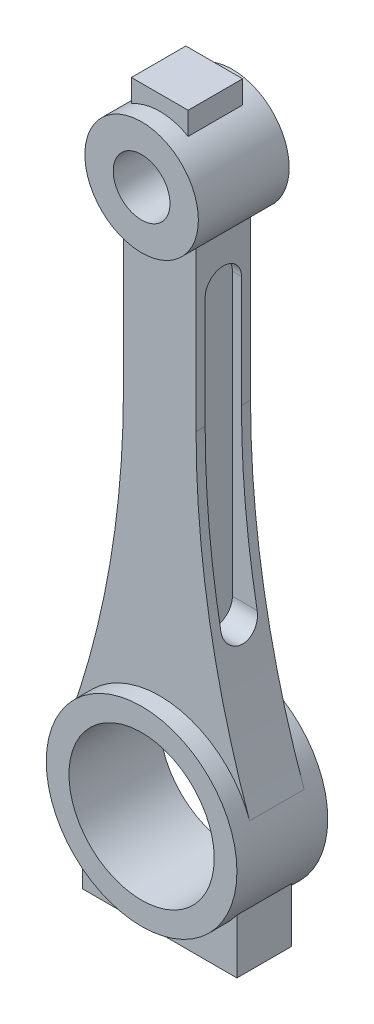
ISO-10303-21;
HEADER;
FILE_DESCRIPTION(('STEP AP214'),'2;1');
FILE_NAME('part.step','',(''),(''),'','','');
FILE_SCHEMA(('AUTOMOTIVE_DESIGN { 1 0 10303 214 1 1 1 1 }'));
ENDSEC;
DATA;
#1=APPLICATION_CONTEXT('core data for automotive mechanical design processes');
#2=APPLICATION_PROTOCOL_DEFINITION('international standard','automotive_design',2000,#1);
#3=PRODUCT_CONTEXT('',#1,'mechanical');
#4=PRODUCT('Part','Part','',(#3));
#5=PRODUCT_RELATED_PRODUCT_CATEGORY('part','',(#4));
#6=PRODUCT_DEFINITION_FORMATION('','',#4);
#7=PRODUCT_DEFINITION_CONTEXT('part definition',#1,'design');
#8=PRODUCT_DEFINITION('design','',#6,#7);
#9=PRODUCT_DEFINITION_SHAPE('','',#8);
#10=(LENGTH_UNIT() NAMED_UNIT(*) SI_UNIT(.MILLI.,.METRE.));
#11=(NAMED_UNIT(*) PLANE_ANGLE_UNIT() SI_UNIT($,.RADIAN.));
#12=(NAMED_UNIT(*) SI_UNIT($,.STERADIAN.) SOLID_ANGLE_UNIT());
#13=UNCERTAINTY_MEASURE_WITH_UNIT(LENGTH_MEASURE(1.E-05),#10,'distance_accuracy_value','');
#14=(GEOMETRIC_REPRESENTATION_CONTEXT(3) GLOBAL_UNCERTAINTY_ASSIGNED_CONTEXT((#13)) GLOBAL_UNIT_ASSIGNED_CONTEXT((#10,
#11,#12)) REPRESENTATION_CONTEXT('',''));
#15=CARTESIAN_POINT('',(0.,0.,0.));
#16=DIRECTION('',(0.,0.,1.));
#17=DIRECTION('',(1.,0.,0.));
#18=AXIS2_PLACEMENT_3D('',#15,#16,#17);
#19=CARTESIAN_POINT('',(212.132819979024,75.3953136438508,6.));
#20=DIRECTION('',(0.,0.,-1.));
#21=DIRECTION('',(-1.,0.,0.));
#22=AXIS2_PLACEMENT_3D('',#19,#20,#21);
#23=CYLINDRICAL_SURFACE('',#22,204.132819979024);
#24=CARTESIAN_POINT('',(11.4544735884215,38.,-4.00000000000001));
#25=CARTESIAN_POINT('',(11.4757515518411,37.8858086335559,-4.00000967356236));
#26=CARTESIAN_POINT('',(11.497127848932,37.7716411229782,-3.9951101211208));
#27=CARTESIAN_POINT('',(11.5399210356049,37.544152772884,-3.97557755361704));
#28=CARTESIAN_POINT('',(11.5613379239584,37.4308319082382,-3.9609448286138));
#29=CARTESIAN_POINT('',(11.6040518019029,37.2058589467753,-3.92203609087538));
#30=CARTESIAN_POINT('',(11.6253488219803,37.0942064124742,-3.89776265395078));
#31=CARTESIAN_POINT('',(11.6676599337569,36.8733657612217,-3.83975872762631));
#32=CARTESIAN_POINT('',(11.6886740293759,36.7641776101131,-3.80602836938937));
#33=CARTESIAN_POINT('',(11.7510730473326,36.4413470108117,-3.69089420326938));
#34=CARTESIAN_POINT('',(11.7918289081029,36.2323636826891,-3.59553432969807));
#35=CARTESIAN_POINT('',(11.8702126062764,35.833491871712,-3.37027556179513));
#36=CARTESIAN_POINT('',(11.9078413597511,35.643597793309,-3.24038682968162));
#37=CARTESIAN_POINT('',(11.9784728244352,35.2894796680367,-2.95043691024399));
#38=CARTESIAN_POINT('',(12.0115036519544,35.1250988255321,-2.79057453802654));
#39=CARTESIAN_POINT('',(12.0720036427705,34.8256035029566,-2.44449926104123));
#40=CARTESIAN_POINT('',(12.0994724370193,34.6904909648341,-2.25828460915733));
#41=CARTESIAN_POINT('',(12.1473413477104,34.4559602912754,-1.86832249559896));
#42=CARTESIAN_POINT('',(12.1678582991115,34.3559510460777,-1.664944991045));
#43=CARTESIAN_POINT('',(12.201667760202,34.1915558050773,-1.24372237948287));
#44=CARTESIAN_POINT('',(12.2149615713728,34.1271633917176,-1.0258798867516));
#45=CARTESIAN_POINT('',(12.2336033492388,34.0369591960168,-0.586274812122698));
#46=CARTESIAN_POINT('',(12.2390950212482,34.0104496060439,-0.364661335561847));
#47=CARTESIAN_POINT('',(12.2423732155319,33.9946184843632,0.0799443502249516));
#48=CARTESIAN_POINT('',(12.2401601145853,34.0052951341723,0.302936491499045));
#49=CARTESIAN_POINT('',(12.2281765408432,34.0632127244266,0.741781925824326));
#50=CARTESIAN_POINT('',(12.2184766498272,34.1101121767816,0.957682365575714));
#51=CARTESIAN_POINT('',(12.1919895794175,34.2385791029979,1.37844153266759));
#52=CARTESIAN_POINT('',(12.1752023313576,34.3201469127454,1.58330015300715));
#53=CARTESIAN_POINT('',(12.1350793834177,34.5159552856904,1.97739776157501));
#54=CARTESIAN_POINT('',(12.1117098081663,34.6303649264094,2.16654921549124));
#55=CARTESIAN_POINT('',(12.0593260749273,34.8882465100265,2.52297125984128));
#56=CARTESIAN_POINT('',(12.0303117725959,35.0317191961119,2.69024129055299));
#57=CARTESIAN_POINT('',(11.9671383735568,35.3461665633751,3.00114206510915));
#58=CARTESIAN_POINT('',(11.9329025496515,35.5175545383741,3.1443390498194));
#59=CARTESIAN_POINT('',(11.8607975408038,35.8812712267655,3.40006280722765));
#60=CARTESIAN_POINT('',(11.8229268395298,36.0736086840292,3.51257670427657));
#61=CARTESIAN_POINT('',(11.744011046999,36.4777513253325,3.70593438635492));
#62=CARTESIAN_POINT('',(11.7029182624971,36.6898643551292,3.78611370956408));
#63=CARTESIAN_POINT('',(11.6195357198389,37.1241795414682,3.90944320644274));
#64=CARTESIAN_POINT('',(11.5772477716993,37.3463667203578,3.95264656840455));
#65=CARTESIAN_POINT('',(11.5215540274853,37.6417241762258,3.98457340087694));
#66=CARTESIAN_POINT('',(11.5080944382149,37.713314753212,3.99036111817268));
#67=CARTESIAN_POINT('',(11.4812368188341,37.8565916807734,3.99806924003837));
#68=CARTESIAN_POINT('',(11.467838723541,37.9282776734255,3.99999606757804));
#69=CARTESIAN_POINT('',(11.4544735884215,38.,3.99999999999999));
#70=B_SPLINE_CURVE_WITH_KNOTS('',3,(#24,#25,#26,#27,#28,#29,#30,#31,#32,#33,#34,#35,#36,#37,#38,
#39,#40,#41,#42,#43,#44,#45,#46,#47,#48,#49,#50,#51,#52,#53,#54,#55,#56,#57,#58,#59,#60,#61,#62,
#63,#64,#65,#66,#67,#68,#69),.UNSPECIFIED.,.F.,.F.,(4,2,2,2,2,2,2,2,2,2,2,2,2,2,2,2,2,2,2,2,2,2,
4),(0.,0.348357600629778,0.696704820295753,1.04495903090801,1.39320841164155,2.08947857427322,
2.78554404346985,3.47714614167073,4.16879411353831,4.84816302804556,5.52740949173436,
6.1939753168709,6.86050854603357,7.52083364695976,8.18116514562695,8.84495910470899,
9.50877004017902,10.1834922182609,10.8584970981523,11.546741507572,12.2339942357506,
12.4531452672714,12.6719314158043),.UNSPECIFIED.);
#71=CARTESIAN_POINT('',(11.4544735884215,38.,-4.00000000000001));
#72=VERTEX_POINT('',#71);
#73=CARTESIAN_POINT('',(11.4544735884215,38.,3.99999999999999));
#74=VERTEX_POINT('',#73);
#75=EDGE_CURVE('E400',#72,#74,#70,.T.);
#76=ORIENTED_EDGE('',*,*,#75,.T.);
#77=CARTESIAN_POINT('',(212.132819979024,75.3953136438508,3.99999999999999));
#78=DIRECTION('',(0.,0.,-1.));
#79=DIRECTION('',(0.,1.,0.));
#80=AXIS2_PLACEMENT_3D('',#77,#78,#79);
#81=CIRCLE('',#80,204.132819979024);
#82=CARTESIAN_POINT('',(8.00000000000001,75.3953136438507,4.));
#83=VERTEX_POINT('',#82);
#84=EDGE_CURVE('E250',#74,#83,#81,.T.);
#85=ORIENTED_EDGE('',*,*,#84,.T.);
#86=DIRECTION('',(0.,0.,-1.));
#87=VECTOR('',#86,1.);
#88=CARTESIAN_POINT('',(8.00000000000001,75.3953136438507,6.));
#89=LINE('',#88,#87);
#90=CARTESIAN_POINT('',(8.00000000000001,75.3953136438507,6.));
#91=VERTEX_POINT('',#90);
#92=EDGE_CURVE('E367',#91,#83,#89,.T.);
#93=ORIENTED_EDGE('',*,*,#92,.F.);
#94=CARTESIAN_POINT('',(212.132819979024,75.3953136438508,6.));
#95=DIRECTION('',(0.,0.,1.));
#96=DIRECTION('',(1.,0.,0.));
#97=AXIS2_PLACEMENT_3D('',#94,#95,#96);
#98=CIRCLE('',#97,204.132819979024);
#99=CARTESIAN_POINT('',(19.7873824881444,7.03274443356766,6.));
#100=VERTEX_POINT('',#99);
#101=EDGE_CURVE('E342',#91,#100,#98,.T.);
#102=ORIENTED_EDGE('',*,*,#101,.T.);
#103=DIRECTION('',(0.,0.,-1.));
#104=VECTOR('',#103,1.);
#105=CARTESIAN_POINT('',(19.7873824881444,7.03274443356764,6.));
#106=LINE('',#105,#104);
#107=CARTESIAN_POINT('',(19.7873824881444,7.03274443356765,-6.));
#108=VERTEX_POINT('',#107);
#109=EDGE_CURVE('E370',#100,#108,#106,.T.);
#110=ORIENTED_EDGE('',*,*,#109,.T.);
#111=CARTESIAN_POINT('',(212.132819979024,75.3953136438508,-6.));
#112=DIRECTION('',(0.,0.,1.));
#113=DIRECTION('',(1.,0.,0.));
#114=AXIS2_PLACEMENT_3D('',#111,#112,#113);
#115=CIRCLE('',#114,204.132819979024);
#116=CARTESIAN_POINT('',(8.00000000000001,75.3953136438507,-6.));
#117=VERTEX_POINT('',#116);
#118=EDGE_CURVE('E360',#117,#108,#115,.T.);
#119=ORIENTED_EDGE('',*,*,#118,.F.);
#120=CARTESIAN_POINT('',(8.00000000000001,75.3953136438507,-4.));
#121=VERTEX_POINT('',#120);
#122=EDGE_CURVE('E366',#121,#117,#89,.T.);
#123=ORIENTED_EDGE('',*,*,#122,.F.);
#124=CARTESIAN_POINT('',(212.132819979024,75.3953136438508,-4.00000000000001));
#125=DIRECTION('',(0.,0.,1.));
#126=DIRECTION('',(0.,-1.,0.));
#127=AXIS2_PLACEMENT_3D('',#124,#125,#126);
#128=CIRCLE('',#127,204.132819979024);
#129=EDGE_CURVE('E58',#121,#72,#128,.T.);
#130=ORIENTED_EDGE('',*,*,#129,.T.);
#131=EDGE_LOOP('',(#76,#85,#93,#102,#110,#119,#123,#130));
#132=FACE_BOUND('',#131,.T.);
#133=ADVANCED_FACE('F35',(#132),#23,.F.);
#134=CARTESIAN_POINT('',(8.00000000000003,0.,6.));
#135=DIRECTION('',(-1.,0.,0.));
#136=DIRECTION('',(0.,-1.,0.));
#137=AXIS2_PLACEMENT_3D('',#134,#135,#136);
#138=PLANE('',#137);
#139=DIRECTION('',(0.,-1.,0.));
#140=VECTOR('',#139,1.);
#141=CARTESIAN_POINT('',(8.00000000000003,0.,3.99999999999999));
#142=LINE('',#141,#140);
#143=CARTESIAN_POINT('',(8.00000000000001,100.,4.));
#144=VERTEX_POINT('',#143);
#145=EDGE_CURVE('E398',#144,#83,#142,.T.);
#146=ORIENTED_EDGE('',*,*,#145,.F.);
#147=CARTESIAN_POINT('',(8.00000000000001,100.,0.));
#148=DIRECTION('',(-1.,0.,0.));
#149=DIRECTION('',(0.,-1.,0.));
#150=AXIS2_PLACEMENT_3D('',#147,#148,#149);
#151=CIRCLE('',#150,4.);
#152=CARTESIAN_POINT('',(8.00000000000001,100.,-4.));
#153=VERTEX_POINT('',#152);
#154=EDGE_CURVE('E396',#153,#144,#151,.F.);
#155=ORIENTED_EDGE('',*,*,#154,.F.);
#156=DIRECTION('',(0.,1.,0.));
#157=VECTOR('',#156,1.);
#158=CARTESIAN_POINT('',(8.00000000000003,0.,-4.00000000000002));
#159=LINE('',#158,#157);
#160=EDGE_CURVE('E390',#121,#153,#159,.T.);
#161=ORIENTED_EDGE('',*,*,#160,.F.);
#162=ORIENTED_EDGE('',*,*,#122,.T.);
#163=DIRECTION('',(0.,1.,0.));
#164=VECTOR('',#163,1.);
#165=CARTESIAN_POINT('',(8.00000000000003,0.,-6.));
#166=LINE('',#165,#164);
#167=CARTESIAN_POINT('',(8.,110.395313643851,-6.));
#168=VERTEX_POINT('',#167);
#169=EDGE_CURVE('E334',#117,#168,#166,.T.);
#170=ORIENTED_EDGE('',*,*,#169,.T.);
#171=DIRECTION('',(0.,0.,-1.));
#172=VECTOR('',#171,1.);
#173=CARTESIAN_POINT('',(8.,110.395313643851,6.));
#174=LINE('',#173,#172);
#175=CARTESIAN_POINT('',(8.,110.395313643851,6.));
#176=VERTEX_POINT('',#175);
#177=EDGE_CURVE('E348',#176,#168,#174,.T.);
#178=ORIENTED_EDGE('',*,*,#177,.F.);
#179=DIRECTION('',(0.,1.,0.));
#180=VECTOR('',#179,1.);
#181=CARTESIAN_POINT('',(8.00000000000003,0.,6.));
#182=LINE('',#181,#180);
#183=EDGE_CURVE('E345',#91,#176,#182,.T.);
#184=ORIENTED_EDGE('',*,*,#183,.F.);
#185=ORIENTED_EDGE('',*,*,#92,.T.);
#186=EDGE_LOOP('',(#146,#155,#161,#162,#170,#178,#184,#185));
#187=FACE_BOUND('',#186,.T.);
#188=ADVANCED_FACE('F493',(#187),#138,.F.);
#189=CARTESIAN_POINT('',(0.,0.,10.));
#190=DIRECTION('',(0.,0.,-1.));
#191=DIRECTION('',(-1.,0.,0.));
#192=AXIS2_PLACEMENT_3D('',#189,#190,#191);
#193=CYLINDRICAL_SURFACE('',#192,16.);
#194=CARTESIAN_POINT('',(0.,0.,10.));
#195=DIRECTION('',(0.,0.,1.));
#196=DIRECTION('',(1.,0.,0.));
#197=AXIS2_PLACEMENT_3D('',#194,#195,#196);
#198=CIRCLE('',#197,16.);
#199=CARTESIAN_POINT('',(16.,0.,10.));
#200=VERTEX_POINT('',#199);
#201=EDGE_CURVE('E383',#200,#200,#198,.T.);
#202=ORIENTED_EDGE('',*,*,#201,.T.);
#203=EDGE_LOOP('',(#202));
#204=FACE_BOUND('',#203,.T.);
#205=CARTESIAN_POINT('',(0.,0.,-10.));
#206=DIRECTION('',(0.,0.,1.));
#207=DIRECTION('',(1.,0.,0.));
#208=AXIS2_PLACEMENT_3D('',#205,#206,#207);
#209=CIRCLE('',#208,16.);
#210=CARTESIAN_POINT('',(16.,0.,-10.));
#211=VERTEX_POINT('',#210);
#212=EDGE_CURVE('E382',#211,#211,#209,.T.);
#213=ORIENTED_EDGE('',*,*,#212,.F.);
#214=EDGE_LOOP('',(#213));
#215=FACE_BOUND('',#214,.T.);
#216=ADVANCED_FACE('F37',(#204,#215),#193,.F.);
#217=CARTESIAN_POINT('',(0.,0.,10.));
#218=DIRECTION('',(0.,0.,-1.));
#219=DIRECTION('',(-1.,0.,0.));
#220=AXIS2_PLACEMENT_3D('',#217,#218,#219);
#221=CYLINDRICAL_SURFACE('',#220,21.);
#222=DIRECTION('',(0.,0.,-1.));
#223=VECTOR('',#222,1.);
#224=CARTESIAN_POINT('',(-17.,-12.328828005938,6.));
#225=LINE('',#224,#223);
#226=CARTESIAN_POINT('',(-17.,-12.328828005938,6.));
#227=VERTEX_POINT('',#226);
#228=CARTESIAN_POINT('',(-17.,-12.328828005938,-6.));
#229=VERTEX_POINT('',#228);
#230=EDGE_CURVE('E282',#227,#229,#225,.T.);
#231=ORIENTED_EDGE('',*,*,#230,.F.);
#232=CARTESIAN_POINT('',(0.,0.,6.));
#233=DIRECTION('',(0.,0.,1.));
#234=DIRECTION('',(1.,0.,0.));
#235=AXIS2_PLACEMENT_3D('',#232,#233,#234);
#236=CIRCLE('',#235,21.);
#237=CARTESIAN_POINT('',(17.,-12.3288280059379,6.));
#238=VERTEX_POINT('',#237);
#239=EDGE_CURVE('E254',#227,#238,#236,.T.);
#240=ORIENTED_EDGE('',*,*,#239,.T.);
#241=DIRECTION('',(0.,0.,-1.));
#242=VECTOR('',#241,1.);
#243=CARTESIAN_POINT('',(17.,-12.328828005938,6.));
#244=LINE('',#243,#242);
#245=CARTESIAN_POINT('',(17.,-12.328828005938,-6.));
#246=VERTEX_POINT('',#245);
#247=EDGE_CURVE('E266',#238,#246,#244,.T.);
#248=ORIENTED_EDGE('',*,*,#247,.T.);
#249=CARTESIAN_POINT('',(0.,0.,-6.));
#250=DIRECTION('',(0.,0.,1.));
#251=DIRECTION('',(1.,0.,0.));
#252=AXIS2_PLACEMENT_3D('',#249,#250,#251);
#253=CIRCLE('',#252,21.);
#254=EDGE_CURVE('E253',#229,#246,#253,.T.);
#255=ORIENTED_EDGE('',*,*,#254,.F.);
#256=EDGE_LOOP('',(#231,#240,#248,#255));
#257=FACE_BOUND('',#256,.T.);
#258=ORIENTED_EDGE('',*,*,#109,.F.);
#259=CARTESIAN_POINT('',(0.,0.,6.));
#260=DIRECTION('',(0.,0.,1.));
#261=DIRECTION('',(1.,0.,0.));
#262=AXIS2_PLACEMENT_3D('',#259,#260,#261);
#263=CIRCLE('',#262,21.);
#264=CARTESIAN_POINT('',(-19.7873824881444,7.03274443356763,6.));
#265=VERTEX_POINT('',#264);
#266=EDGE_CURVE('E340',#100,#265,#263,.T.);
#267=ORIENTED_EDGE('',*,*,#266,.T.);
#268=DIRECTION('',(0.,0.,-1.));
#269=VECTOR('',#268,1.);
#270=CARTESIAN_POINT('',(-19.7873824881444,7.03274443356764,6.));
#271=LINE('',#270,#269);
#272=CARTESIAN_POINT('',(-19.7873824881444,7.03274443356764,-6.));
#273=VERTEX_POINT('',#272);
#274=EDGE_CURVE('E373',#265,#273,#271,.T.);
#275=ORIENTED_EDGE('',*,*,#274,.T.);
#276=CARTESIAN_POINT('',(0.,0.,-6.));
#277=DIRECTION('',(0.,0.,1.));
#278=DIRECTION('',(1.,0.,0.));
#279=AXIS2_PLACEMENT_3D('',#276,#277,#278);
#280=CIRCLE('',#279,21.);
#281=EDGE_CURVE('E357',#108,#273,#280,.T.);
#282=ORIENTED_EDGE('',*,*,#281,.F.);
#283=EDGE_LOOP('',(#258,#267,#275,#282));
#284=FACE_BOUND('',#283,.T.);
#285=CARTESIAN_POINT('',(0.,0.,10.));
#286=DIRECTION('',(0.,0.,1.));
#287=DIRECTION('',(1.,0.,0.));
#288=AXIS2_PLACEMENT_3D('',#285,#286,#287);
#289=CIRCLE('',#288,21.);
#290=CARTESIAN_POINT('',(21.,0.,10.));
#291=VERTEX_POINT('',#290);
#292=EDGE_CURVE('E386',#291,#291,#289,.T.);
#293=ORIENTED_EDGE('',*,*,#292,.F.);
#294=EDGE_LOOP('',(#293));
#295=FACE_BOUND('',#294,.T.);
#296=CARTESIAN_POINT('',(0.,0.,-10.));
#297=DIRECTION('',(0.,0.,1.));
#298=DIRECTION('',(1.,0.,0.));
#299=AXIS2_PLACEMENT_3D('',#296,#297,#298);
#300=CIRCLE('',#299,21.);
#301=CARTESIAN_POINT('',(21.,0.,-10.));
#302=VERTEX_POINT('',#301);
#303=EDGE_CURVE('E387',#302,#302,#300,.T.);
#304=ORIENTED_EDGE('',*,*,#303,.T.);
#305=EDGE_LOOP('',(#304));
#306=FACE_BOUND('',#305,.T.);
#307=ADVANCED_FACE('F500',(#257,#284,#295,#306),#221,.T.);
#308=CARTESIAN_POINT('',(0.,0.,10.));
#309=DIRECTION('',(0.,0.,1.));
#310=DIRECTION('',(1.,0.,0.));
#311=AXIS2_PLACEMENT_3D('',#308,#309,#310);
#312=PLANE('',#311);
#313=ORIENTED_EDGE('',*,*,#201,.F.);
#314=EDGE_LOOP('',(#313));
#315=FACE_BOUND('',#314,.T.);
#316=ORIENTED_EDGE('',*,*,#292,.T.);
#317=EDGE_LOOP('',(#316));
#318=FACE_BOUND('',#317,.T.);
#319=ADVANCED_FACE('F546',(#315,#318),#312,.T.);
#320=CARTESIAN_POINT('',(0.,0.,-10.));
#321=DIRECTION('',(0.,0.,1.));
#322=DIRECTION('',(1.,0.,0.));
#323=AXIS2_PLACEMENT_3D('',#320,#321,#322);
#324=PLANE('',#323);
#325=ORIENTED_EDGE('',*,*,#212,.T.);
#326=EDGE_LOOP('',(#325));
#327=FACE_BOUND('',#326,.T.);
#328=ORIENTED_EDGE('',*,*,#303,.F.);
#329=EDGE_LOOP('',(#328));
#330=FACE_BOUND('',#329,.T.);
#331=ADVANCED_FACE('F544',(#327,#330),#324,.F.);
#332=CARTESIAN_POINT('',(-7.99999999999999,0.,6.));
#333=DIRECTION('',(-1.,0.,0.));
#334=DIRECTION('',(0.,0.,1.));
#335=AXIS2_PLACEMENT_3D('',#332,#333,#334);
#336=PLANE('',#335);
#337=DIRECTION('',(0.,-1.,0.));
#338=VECTOR('',#337,1.);
#339=CARTESIAN_POINT('',(-7.99999999999999,0.,-4.00000000000002));
#340=LINE('',#339,#338);
#341=CARTESIAN_POINT('',(-7.99999999999999,100.,-4.));
#342=VERTEX_POINT('',#341);
#343=CARTESIAN_POINT('',(-8.00000000000001,75.3953136438507,-4.00000000000001));
#344=VERTEX_POINT('',#343);
#345=EDGE_CURVE('E227',#342,#344,#340,.T.);
#346=ORIENTED_EDGE('',*,*,#345,.F.);
#347=CARTESIAN_POINT('',(-7.99999999999999,100.,0.));
#348=DIRECTION('',(-1.,0.,0.));
#349=DIRECTION('',(0.,0.,1.));
#350=AXIS2_PLACEMENT_3D('',#347,#348,#349);
#351=CIRCLE('',#350,4.);
#352=CARTESIAN_POINT('',(-7.99999999999999,100.,4.));
#353=VERTEX_POINT('',#352);
#354=EDGE_CURVE('E11',#353,#342,#351,.T.);
#355=ORIENTED_EDGE('',*,*,#354,.F.);
#356=DIRECTION('',(0.,1.,0.));
#357=VECTOR('',#356,1.);
#358=CARTESIAN_POINT('',(-7.99999999999999,0.,3.99999999999999));
#359=LINE('',#358,#357);
#360=CARTESIAN_POINT('',(-8.00000000000001,75.3953136438507,3.99999999999999));
#361=VERTEX_POINT('',#360);
#362=EDGE_CURVE('E199',#361,#353,#359,.T.);
#363=ORIENTED_EDGE('',*,*,#362,.F.);
#364=DIRECTION('',(0.,0.,-1.));
#365=VECTOR('',#364,1.);
#366=CARTESIAN_POINT('',(-7.99999999999999,75.3953136438507,6.));
#367=LINE('',#366,#365);
#368=CARTESIAN_POINT('',(-7.99999999999999,75.3953136438507,6.));
#369=VERTEX_POINT('',#368);
#370=EDGE_CURVE('E376',#369,#361,#367,.T.);
#371=ORIENTED_EDGE('',*,*,#370,.F.);
#372=DIRECTION('',(0.,1.,0.));
#373=VECTOR('',#372,1.);
#374=CARTESIAN_POINT('',(-7.99999999999999,0.,6.));
#375=LINE('',#374,#373);
#376=CARTESIAN_POINT('',(-7.99999999999999,110.395313643851,6.));
#377=VERTEX_POINT('',#376);
#378=EDGE_CURVE('E333',#369,#377,#375,.T.);
#379=ORIENTED_EDGE('',*,*,#378,.T.);
#380=DIRECTION('',(0.,0.,-1.));
#381=VECTOR('',#380,1.);
#382=CARTESIAN_POINT('',(-7.99999999999999,110.395313643851,6.));
#383=LINE('',#382,#381);
#384=CARTESIAN_POINT('',(-7.99999999999999,110.395313643851,-6.));
#385=VERTEX_POINT('',#384);
#386=EDGE_CURVE('E379',#377,#385,#383,.T.);
#387=ORIENTED_EDGE('',*,*,#386,.T.);
#388=DIRECTION('',(0.,1.,0.));
#389=VECTOR('',#388,1.);
#390=CARTESIAN_POINT('',(-7.99999999999999,0.,-6.));
#391=LINE('',#390,#389);
#392=CARTESIAN_POINT('',(-7.99999999999999,75.3953136438507,-6.));
#393=VERTEX_POINT('',#392);
#394=EDGE_CURVE('E351',#393,#385,#391,.T.);
#395=ORIENTED_EDGE('',*,*,#394,.F.);
#396=EDGE_CURVE('E375',#344,#393,#367,.T.);
#397=ORIENTED_EDGE('',*,*,#396,.F.);
#398=EDGE_LOOP('',(#346,#355,#363,#371,#379,#387,#395,#397));
#399=FACE_BOUND('',#398,.T.);
#400=ADVANCED_FACE('F540',(#399),#336,.T.);
#401=CARTESIAN_POINT('',(-212.132819979024,75.3953136438507,6.));
#402=DIRECTION('',(0.,0.,-1.));
#403=DIRECTION('',(-1.,0.,0.));
#404=AXIS2_PLACEMENT_3D('',#401,#402,#403);
#405=CYLINDRICAL_SURFACE('',#404,204.132819979024);
#406=CARTESIAN_POINT('',(-11.4544735884215,38.,3.99999999999999));
#407=CARTESIAN_POINT('',(-11.4757515518411,37.8858086335559,4.00000967356234));
#408=CARTESIAN_POINT('',(-11.497127848932,37.7716411229782,3.99511012112078));
#409=CARTESIAN_POINT('',(-11.5399210356049,37.5441527728839,3.97557755361703));
#410=CARTESIAN_POINT('',(-11.5613379239584,37.4308319082382,3.96094482861378));
#411=CARTESIAN_POINT('',(-11.6040518019029,37.2058589467753,3.92203609087536));
#412=CARTESIAN_POINT('',(-11.6253488219803,37.0942064124742,3.89776265395076));
#413=CARTESIAN_POINT('',(-11.6676599337569,36.8733657612217,3.83975872762629));
#414=CARTESIAN_POINT('',(-11.6886740293759,36.7641776101131,3.80602836938935));
#415=CARTESIAN_POINT('',(-11.7510730473326,36.4413470108117,3.69089420326937));
#416=CARTESIAN_POINT('',(-11.7918289081029,36.2323636826891,3.59553432969806));
#417=CARTESIAN_POINT('',(-11.8702126062764,35.833491871712,3.37027556179512));
#418=CARTESIAN_POINT('',(-11.9078413597511,35.643597793309,3.24038682968161));
#419=CARTESIAN_POINT('',(-11.9784728244352,35.2894796680367,2.95043691024398));
#420=CARTESIAN_POINT('',(-12.0115036519544,35.1250988255321,2.79057453802654));
#421=CARTESIAN_POINT('',(-12.0720036427705,34.8256035029566,2.44449926104122));
#422=CARTESIAN_POINT('',(-12.0994724370193,34.6904909648341,2.25828460915732));
#423=CARTESIAN_POINT('',(-12.1473413477104,34.4559602912754,1.86832249559895));
#424=CARTESIAN_POINT('',(-12.1678582991115,34.3559510460777,1.66494499104499));
#425=CARTESIAN_POINT('',(-12.201667760202,34.1915558050773,1.24372237948286));
#426=CARTESIAN_POINT('',(-12.2149615713728,34.1271633917176,1.02587988675159));
#427=CARTESIAN_POINT('',(-12.2336033492387,34.0369591960168,0.58627481212269));
#428=CARTESIAN_POINT('',(-12.2390950212481,34.0104496060439,0.36466133556184));
#429=CARTESIAN_POINT('',(-12.2423732155318,33.9946184843632,-0.0799443502249558));
#430=CARTESIAN_POINT('',(-12.2401601145853,34.0052951341723,-0.302936491499049));
#431=CARTESIAN_POINT('',(-12.2281765408432,34.0632127244266,-0.74178192582433));
#432=CARTESIAN_POINT('',(-12.2184766498272,34.1101121767816,-0.957682365575718));
#433=CARTESIAN_POINT('',(-12.1919895794175,34.2385791029979,-1.3784415326676));
#434=CARTESIAN_POINT('',(-12.1752023313576,34.3201469127454,-1.58330015300716));
#435=CARTESIAN_POINT('',(-12.1350793834177,34.5159552856904,-1.97739776157502));
#436=CARTESIAN_POINT('',(-12.1117098081663,34.6303649264094,-2.16654921549124));
#437=CARTESIAN_POINT('',(-12.0593260749272,34.8882465100265,-2.52297125984129));
#438=CARTESIAN_POINT('',(-12.0303117725959,35.0317191961119,-2.690241290553));
#439=CARTESIAN_POINT('',(-11.9671383735568,35.3461665633751,-3.00114206510916));
#440=CARTESIAN_POINT('',(-11.9329025496515,35.5175545383741,-3.14433904981941));
#441=CARTESIAN_POINT('',(-11.8607975408038,35.8812712267655,-3.40006280722766));
#442=CARTESIAN_POINT('',(-11.8229268395298,36.0736086840292,-3.51257670427658));
#443=CARTESIAN_POINT('',(-11.744011046999,36.4777513253325,-3.70593438635493));
#444=CARTESIAN_POINT('',(-11.7029182624971,36.6898643551292,-3.7861137095641));
#445=CARTESIAN_POINT('',(-11.6195357198389,37.1241795414682,-3.90944320644275));
#446=CARTESIAN_POINT('',(-11.5772477716993,37.3463667203578,-3.95264656840456));
#447=CARTESIAN_POINT('',(-11.5215540274853,37.6417241762258,-3.98457340087696));
#448=CARTESIAN_POINT('',(-11.5080944382149,37.713314753212,-3.9903611181727));
#449=CARTESIAN_POINT('',(-11.4812368188341,37.8565916807733,-3.99806924003838));
#450=CARTESIAN_POINT('',(-11.467838723541,37.9282776734255,-3.99999606757806));
#451=CARTESIAN_POINT('',(-11.4544735884215,38.,-4.00000000000001));
#452=B_SPLINE_CURVE_WITH_KNOTS('',3,(#406,#407,#408,#409,#410,#411,#412,#413,#414,#415,#416,
#417,#418,#419,#420,#421,#422,#423,#424,#425,#426,#427,#428,#429,#430,#431,#432,#433,#434,#435,
#436,#437,#438,#439,#440,#441,#442,#443,#444,#445,#446,#447,#448,#449,#450,#451),.UNSPECIFIED.,
.F.,.F.,(4,2,2,2,2,2,2,2,2,2,2,2,2,2,2,2,2,2,2,2,2,2,4),(0.,0.348357600629773,0.696704820295755,
1.04495903090801,1.39320841164154,2.0894785742732,2.78554404346983,3.47714614167072,
4.1687941135383,4.84816302804556,5.52740949173435,6.19397531687089,6.86050854603355,
7.52083364695974,8.18116514562693,8.84495910470897,9.50877004017901,10.1834922182609,
10.8584970981523,11.546741507572,12.2339942357505,12.4531452672714,12.6719314158043),.UNSPECIFIED.);
#453=CARTESIAN_POINT('',(-11.4544735884215,38.,3.99999999999999));
#454=VERTEX_POINT('',#453);
#455=CARTESIAN_POINT('',(-11.4544735884215,38.,-4.00000000000001));
#456=VERTEX_POINT('',#455);
#457=EDGE_CURVE('E532',#454,#456,#452,.T.);
#458=ORIENTED_EDGE('',*,*,#457,.T.);
#459=CARTESIAN_POINT('',(-212.132819979024,75.3953136438507,-4.00000000000001));
#460=DIRECTION('',(0.,0.,-1.));
#461=DIRECTION('',(0.,1.,0.));
#462=AXIS2_PLACEMENT_3D('',#459,#460,#461);
#463=CIRCLE('',#462,204.132819979024);
#464=EDGE_CURVE('E43',#456,#344,#463,.F.);
#465=ORIENTED_EDGE('',*,*,#464,.T.);
#466=ORIENTED_EDGE('',*,*,#396,.T.);
#467=CARTESIAN_POINT('',(-212.132819979024,75.3953136438507,-6.));
#468=DIRECTION('',(0.,0.,1.));
#469=DIRECTION('',(1.,0.,0.));
#470=AXIS2_PLACEMENT_3D('',#467,#468,#469);
#471=CIRCLE('',#470,204.132819979024);
#472=EDGE_CURVE('E354',#393,#273,#471,.F.);
#473=ORIENTED_EDGE('',*,*,#472,.T.);
#474=ORIENTED_EDGE('',*,*,#274,.F.);
#475=CARTESIAN_POINT('',(-212.132819979024,75.3953136438507,6.));
#476=DIRECTION('',(0.,0.,1.));
#477=DIRECTION('',(1.,0.,0.));
#478=AXIS2_PLACEMENT_3D('',#475,#476,#477);
#479=CIRCLE('',#478,204.132819979024);
#480=EDGE_CURVE('E337',#369,#265,#479,.F.);
#481=ORIENTED_EDGE('',*,*,#480,.F.);
#482=ORIENTED_EDGE('',*,*,#370,.T.);
#483=CARTESIAN_POINT('',(-212.132819979024,75.3953136438507,3.99999999999999));
#484=DIRECTION('',(0.,0.,1.));
#485=DIRECTION('',(0.,-1.,0.));
#486=AXIS2_PLACEMENT_3D('',#483,#484,#485);
#487=CIRCLE('',#486,204.132819979024);
#488=EDGE_CURVE('E408',#361,#454,#487,.F.);
#489=ORIENTED_EDGE('',*,*,#488,.T.);
#490=EDGE_LOOP('',(#458,#465,#466,#473,#474,#481,#482,#489));
#491=FACE_BOUND('',#490,.T.);
#492=ADVANCED_FACE('F489',(#491),#405,.F.);
#493=CARTESIAN_POINT('',(0.,0.,6.));
#494=DIRECTION('',(0.,0.,1.));
#495=DIRECTION('',(1.,0.,0.));
#496=AXIS2_PLACEMENT_3D('',#493,#494,#495);
#497=PLANE('',#496);
#498=CARTESIAN_POINT('',(0.,120.,6.));
#499=DIRECTION('',(0.,0.,1.));
#500=DIRECTION('',(1.,0.,0.));
#501=AXIS2_PLACEMENT_3D('',#498,#499,#500);
#502=CIRCLE('',#501,12.5);
#503=EDGE_CURVE('E331',#377,#176,#502,.T.);
#504=ORIENTED_EDGE('',*,*,#503,.F.);
#505=ORIENTED_EDGE('',*,*,#378,.F.);
#506=ORIENTED_EDGE('',*,*,#480,.T.);
#507=ORIENTED_EDGE('',*,*,#266,.F.);
#508=ORIENTED_EDGE('',*,*,#101,.F.);
#509=ORIENTED_EDGE('',*,*,#183,.T.);
#510=EDGE_LOOP('',(#504,#505,#506,#507,#508,#509));
#511=FACE_BOUND('',#510,.T.);
#512=ADVANCED_FACE('F486',(#511),#497,.T.);
#513=CARTESIAN_POINT('',(0.,0.,-6.));
#514=DIRECTION('',(0.,0.,1.));
#515=DIRECTION('',(1.,0.,0.));
#516=AXIS2_PLACEMENT_3D('',#513,#514,#515);
#517=PLANE('',#516);
#518=CARTESIAN_POINT('',(0.,120.,-6.));
#519=DIRECTION('',(0.,0.,1.));
#520=DIRECTION('',(1.,0.,0.));
#521=AXIS2_PLACEMENT_3D('',#518,#519,#520);
#522=CIRCLE('',#521,12.5);
#523=EDGE_CURVE('E326',#385,#168,#522,.T.);
#524=ORIENTED_EDGE('',*,*,#523,.T.);
#525=ORIENTED_EDGE('',*,*,#169,.F.);
#526=ORIENTED_EDGE('',*,*,#118,.T.);
#527=ORIENTED_EDGE('',*,*,#281,.T.);
#528=ORIENTED_EDGE('',*,*,#472,.F.);
#529=ORIENTED_EDGE('',*,*,#394,.T.);
#530=EDGE_LOOP('',(#524,#525,#526,#527,#528,#529));
#531=FACE_BOUND('',#530,.T.);
#532=ADVANCED_FACE('F484',(#531),#517,.F.);
#533=CARTESIAN_POINT('',(0.,120.,10.));
#534=DIRECTION('',(0.,0.,-1.));
#535=DIRECTION('',(-1.,0.,0.));
#536=AXIS2_PLACEMENT_3D('',#533,#534,#535);
#537=CYLINDRICAL_SURFACE('',#536,6.25);
#538=CARTESIAN_POINT('',(0.,120.,10.));
#539=DIRECTION('',(0.,0.,1.));
#540=DIRECTION('',(1.,0.,0.));
#541=AXIS2_PLACEMENT_3D('',#538,#539,#540);
#542=CIRCLE('',#541,6.25);
#543=CARTESIAN_POINT('',(6.25,120.,10.));
#544=VERTEX_POINT('',#543);
#545=EDGE_CURVE('E319',#544,#544,#542,.T.);
#546=ORIENTED_EDGE('',*,*,#545,.T.);
#547=EDGE_LOOP('',(#546));
#548=FACE_BOUND('',#547,.T.);
#549=CARTESIAN_POINT('',(0.,120.,-10.));
#550=DIRECTION('',(0.,0.,1.));
#551=DIRECTION('',(1.,0.,0.));
#552=AXIS2_PLACEMENT_3D('',#549,#550,#551);
#553=CIRCLE('',#552,6.25);
#554=CARTESIAN_POINT('',(6.25,120.,-10.));
#555=VERTEX_POINT('',#554);
#556=EDGE_CURVE('E318',#555,#555,#553,.T.);
#557=ORIENTED_EDGE('',*,*,#556,.F.);
#558=EDGE_LOOP('',(#557));
#559=FACE_BOUND('',#558,.T.);
#560=ADVANCED_FACE('F480',(#548,#559),#537,.F.);
#561=CARTESIAN_POINT('',(0.,120.,10.));
#562=DIRECTION('',(0.,0.,-1.));
#563=DIRECTION('',(-1.,0.,0.));
#564=AXIS2_PLACEMENT_3D('',#561,#562,#563);
#565=CYLINDRICAL_SURFACE('',#564,12.5);
#566=DIRECTION('',(0.,0.,-1.));
#567=VECTOR('',#566,1.);
#568=CARTESIAN_POINT('',(6.25,130.825317547305,6.));
#569=LINE('',#568,#567);
#570=CARTESIAN_POINT('',(6.25,130.825317547305,6.));
#571=VERTEX_POINT('',#570);
#572=CARTESIAN_POINT('',(6.25,130.825317547305,-6.));
#573=VERTEX_POINT('',#572);
#574=EDGE_CURVE('E310',#571,#573,#569,.T.);
#575=ORIENTED_EDGE('',*,*,#574,.F.);
#576=CARTESIAN_POINT('',(0.,120.,6.));
#577=DIRECTION('',(0.,0.,1.));
#578=DIRECTION('',(1.,0.,0.));
#579=AXIS2_PLACEMENT_3D('',#576,#577,#578);
#580=CIRCLE('',#579,12.5);
#581=CARTESIAN_POINT('',(-6.25,130.825317547305,6.));
#582=VERTEX_POINT('',#581);
#583=EDGE_CURVE('E293',#571,#582,#580,.T.);
#584=ORIENTED_EDGE('',*,*,#583,.T.);
#585=DIRECTION('',(0.,0.,-1.));
#586=VECTOR('',#585,1.);
#587=CARTESIAN_POINT('',(-6.25,130.825317547305,6.));
#588=LINE('',#587,#586);
#589=CARTESIAN_POINT('',(-6.25,130.825317547305,-6.));
#590=VERTEX_POINT('',#589);
#591=EDGE_CURVE('E313',#582,#590,#588,.T.);
#592=ORIENTED_EDGE('',*,*,#591,.T.);
#593=CARTESIAN_POINT('',(0.,120.,-6.));
#594=DIRECTION('',(0.,0.,1.));
#595=DIRECTION('',(1.,0.,0.));
#596=AXIS2_PLACEMENT_3D('',#593,#594,#595);
#597=CIRCLE('',#596,12.5);
#598=EDGE_CURVE('E304',#573,#590,#597,.T.);
#599=ORIENTED_EDGE('',*,*,#598,.F.);
#600=EDGE_LOOP('',(#575,#584,#592,#599));
#601=FACE_BOUND('',#600,.T.);
#602=ORIENTED_EDGE('',*,*,#503,.T.);
#603=ORIENTED_EDGE('',*,*,#177,.T.);
#604=ORIENTED_EDGE('',*,*,#523,.F.);
#605=ORIENTED_EDGE('',*,*,#386,.F.);
#606=EDGE_LOOP('',(#602,#603,#604,#605));
#607=FACE_BOUND('',#606,.T.);
#608=CARTESIAN_POINT('',(0.,120.,10.));
#609=DIRECTION('',(0.,0.,1.));
#610=DIRECTION('',(1.,0.,0.));
#611=AXIS2_PLACEMENT_3D('',#608,#609,#610);
#612=CIRCLE('',#611,12.5);
#613=CARTESIAN_POINT('',(12.5,120.,10.));
#614=VERTEX_POINT('',#613);
#615=EDGE_CURVE('E322',#614,#614,#612,.T.);
#616=ORIENTED_EDGE('',*,*,#615,.F.);
#617=EDGE_LOOP('',(#616));
#618=FACE_BOUND('',#617,.T.);
#619=CARTESIAN_POINT('',(0.,120.,-10.));
#620=DIRECTION('',(0.,0.,1.));
#621=DIRECTION('',(1.,0.,0.));
#622=AXIS2_PLACEMENT_3D('',#619,#620,#621);
#623=CIRCLE('',#622,12.5);
#624=CARTESIAN_POINT('',(12.5,120.,-10.));
#625=VERTEX_POINT('',#624);
#626=EDGE_CURVE('E323',#625,#625,#623,.T.);
#627=ORIENTED_EDGE('',*,*,#626,.T.);
#628=EDGE_LOOP('',(#627));
#629=FACE_BOUND('',#628,.T.);
#630=ADVANCED_FACE('F473',(#601,#607,#618,#629),#565,.T.);
#631=CARTESIAN_POINT('',(0.,0.,10.));
#632=DIRECTION('',(0.,0.,1.));
#633=DIRECTION('',(1.,0.,0.));
#634=AXIS2_PLACEMENT_3D('',#631,#632,#633);
#635=PLANE('',#634);
#636=ORIENTED_EDGE('',*,*,#545,.F.);
#637=EDGE_LOOP('',(#636));
#638=FACE_BOUND('',#637,.T.);
#639=ORIENTED_EDGE('',*,*,#615,.T.);
#640=EDGE_LOOP('',(#639));
#641=FACE_BOUND('',#640,.T.);
#642=ADVANCED_FACE('F470',(#638,#641),#635,.T.);
#643=CARTESIAN_POINT('',(0.,0.,-10.));
#644=DIRECTION('',(0.,0.,1.));
#645=DIRECTION('',(1.,0.,0.));
#646=AXIS2_PLACEMENT_3D('',#643,#644,#645);
#647=PLANE('',#646);
#648=ORIENTED_EDGE('',*,*,#556,.T.);
#649=EDGE_LOOP('',(#648));
#650=FACE_BOUND('',#649,.T.);
#651=ORIENTED_EDGE('',*,*,#626,.F.);
#652=EDGE_LOOP('',(#651));
#653=FACE_BOUND('',#652,.T.);
#654=ADVANCED_FACE('F468',(#650,#653),#647,.F.);
#655=CARTESIAN_POINT('',(0.,135.825317547305,6.));
#656=DIRECTION('',(0.,-1.,0.));
#657=DIRECTION('',(0.,0.,-1.));
#658=AXIS2_PLACEMENT_3D('',#655,#656,#657);
#659=PLANE('',#658);
#660=DIRECTION('',(-1.,0.,0.));
#661=VECTOR('',#660,1.);
#662=CARTESIAN_POINT('',(0.,135.825317547305,-6.));
#663=LINE('',#662,#661);
#664=CARTESIAN_POINT('',(6.25,135.825317547305,-6.));
#665=VERTEX_POINT('',#664);
#666=CARTESIAN_POINT('',(-6.25,135.825317547305,-6.));
#667=VERTEX_POINT('',#666);
#668=EDGE_CURVE('E285',#665,#667,#663,.T.);
#669=ORIENTED_EDGE('',*,*,#668,.T.);
#670=DIRECTION('',(0.,0.,-1.));
#671=VECTOR('',#670,1.);
#672=CARTESIAN_POINT('',(-6.25,135.825317547305,6.));
#673=LINE('',#672,#671);
#674=CARTESIAN_POINT('',(-6.25,135.825317547305,6.));
#675=VERTEX_POINT('',#674);
#676=EDGE_CURVE('E315',#675,#667,#673,.T.);
#677=ORIENTED_EDGE('',*,*,#676,.F.);
#678=DIRECTION('',(-1.,0.,0.));
#679=VECTOR('',#678,1.);
#680=CARTESIAN_POINT('',(0.,135.825317547305,6.));
#681=LINE('',#680,#679);
#682=CARTESIAN_POINT('',(6.25,135.825317547305,6.));
#683=VERTEX_POINT('',#682);
#684=EDGE_CURVE('E286',#683,#675,#681,.T.);
#685=ORIENTED_EDGE('',*,*,#684,.F.);
#686=DIRECTION('',(0.,0.,-1.));
#687=VECTOR('',#686,1.);
#688=CARTESIAN_POINT('',(6.25,135.825317547305,6.));
#689=LINE('',#688,#687);
#690=EDGE_CURVE('E298',#683,#665,#689,.T.);
#691=ORIENTED_EDGE('',*,*,#690,.T.);
#692=EDGE_LOOP('',(#669,#677,#685,#691));
#693=FACE_BOUND('',#692,.T.);
#694=ADVANCED_FACE('F464',(#693),#659,.F.);
#695=CARTESIAN_POINT('',(-6.25000000000005,0.,6.));
#696=DIRECTION('',(1.,0.,0.));
#697=DIRECTION('',(0.,1.,0.));
#698=AXIS2_PLACEMENT_3D('',#695,#696,#697);
#699=PLANE('',#698);
#700=DIRECTION('',(0.,-1.,0.));
#701=VECTOR('',#700,1.);
#702=CARTESIAN_POINT('',(-6.25000000000005,0.,-6.));
#703=LINE('',#702,#701);
#704=EDGE_CURVE('E301',#667,#590,#703,.T.);
#705=ORIENTED_EDGE('',*,*,#704,.T.);
#706=ORIENTED_EDGE('',*,*,#591,.F.);
#707=DIRECTION('',(0.,-1.,0.));
#708=VECTOR('',#707,1.);
#709=CARTESIAN_POINT('',(-6.25000000000005,0.,6.));
#710=LINE('',#709,#708);
#711=EDGE_CURVE('E289',#675,#582,#710,.T.);
#712=ORIENTED_EDGE('',*,*,#711,.F.);
#713=ORIENTED_EDGE('',*,*,#676,.T.);
#714=EDGE_LOOP('',(#705,#706,#712,#713));
#715=FACE_BOUND('',#714,.T.);
#716=ADVANCED_FACE('F460',(#715),#699,.F.);
#717=CARTESIAN_POINT('',(6.25000000000005,0.,6.));
#718=DIRECTION('',(1.,0.,0.));
#719=DIRECTION('',(0.,1.,0.));
#720=AXIS2_PLACEMENT_3D('',#717,#718,#719);
#721=PLANE('',#720);
#722=DIRECTION('',(0.,-1.,0.));
#723=VECTOR('',#722,1.);
#724=CARTESIAN_POINT('',(6.25000000000005,0.,-6.));
#725=LINE('',#724,#723);
#726=EDGE_CURVE('E290',#665,#573,#725,.T.);
#727=ORIENTED_EDGE('',*,*,#726,.F.);
#728=ORIENTED_EDGE('',*,*,#690,.F.);
#729=DIRECTION('',(0.,-1.,0.));
#730=VECTOR('',#729,1.);
#731=CARTESIAN_POINT('',(6.25000000000005,0.,6.));
#732=LINE('',#731,#730);
#733=EDGE_CURVE('E295',#683,#571,#732,.T.);
#734=ORIENTED_EDGE('',*,*,#733,.T.);
#735=ORIENTED_EDGE('',*,*,#574,.T.);
#736=EDGE_LOOP('',(#727,#728,#734,#735));
#737=FACE_BOUND('',#736,.T.);
#738=ADVANCED_FACE('F453',(#737),#721,.T.);
#739=CARTESIAN_POINT('',(0.,0.,6.));
#740=DIRECTION('',(0.,0.,1.));
#741=DIRECTION('',(1.,0.,0.));
#742=AXIS2_PLACEMENT_3D('',#739,#740,#741);
#743=PLANE('',#742);
#744=ORIENTED_EDGE('',*,*,#684,.T.);
#745=ORIENTED_EDGE('',*,*,#711,.T.);
#746=ORIENTED_EDGE('',*,*,#583,.F.);
#747=ORIENTED_EDGE('',*,*,#733,.F.);
#748=EDGE_LOOP('',(#744,#745,#746,#747));
#749=FACE_BOUND('',#748,.T.);
#750=ADVANCED_FACE('F450',(#749),#743,.T.);
#751=CARTESIAN_POINT('',(0.,0.,-6.));
#752=DIRECTION('',(0.,0.,1.));
#753=DIRECTION('',(1.,0.,0.));
#754=AXIS2_PLACEMENT_3D('',#751,#752,#753);
#755=PLANE('',#754);
#756=ORIENTED_EDGE('',*,*,#668,.F.);
#757=ORIENTED_EDGE('',*,*,#726,.T.);
#758=ORIENTED_EDGE('',*,*,#598,.T.);
#759=ORIENTED_EDGE('',*,*,#704,.F.);
#760=EDGE_LOOP('',(#756,#757,#758,#759));
#761=FACE_BOUND('',#760,.T.);
#762=ADVANCED_FACE('F448',(#761),#755,.F.);
#763=CARTESIAN_POINT('',(-17.,0.,6.));
#764=DIRECTION('',(-1.,0.,0.));
#765=DIRECTION('',(0.,0.,1.));
#766=AXIS2_PLACEMENT_3D('',#763,#764,#765);
#767=PLANE('',#766);
#768=DIRECTION('',(0.,1.,0.));
#769=VECTOR('',#768,1.);
#770=CARTESIAN_POINT('',(-17.,0.,-6.));
#771=LINE('',#770,#769);
#772=CARTESIAN_POINT('',(-17.,-24.328828005938,-6.));
#773=VERTEX_POINT('',#772);
#774=EDGE_CURVE('E269',#773,#229,#771,.T.);
#775=ORIENTED_EDGE('',*,*,#774,.F.);
#776=DIRECTION('',(0.,0.,-1.));
#777=VECTOR('',#776,1.);
#778=CARTESIAN_POINT('',(-17.,-24.328828005938,6.));
#779=LINE('',#778,#777);
#780=CARTESIAN_POINT('',(-17.,-24.328828005938,6.));
#781=VERTEX_POINT('',#780);
#782=EDGE_CURVE('E280',#781,#773,#779,.T.);
#783=ORIENTED_EDGE('',*,*,#782,.F.);
#784=DIRECTION('',(0.,1.,0.));
#785=VECTOR('',#784,1.);
#786=CARTESIAN_POINT('',(-17.,0.,6.));
#787=LINE('',#786,#785);
#788=EDGE_CURVE('E256',#781,#227,#787,.T.);
#789=ORIENTED_EDGE('',*,*,#788,.T.);
#790=ORIENTED_EDGE('',*,*,#230,.T.);
#791=EDGE_LOOP('',(#775,#783,#789,#790));
#792=FACE_BOUND('',#791,.T.);
#793=ADVANCED_FACE('F444',(#792),#767,.T.);
#794=CARTESIAN_POINT('',(0.,-24.328828005938,6.));
#795=DIRECTION('',(0.,-1.,0.));
#796=DIRECTION('',(1.,0.,0.));
#797=AXIS2_PLACEMENT_3D('',#794,#795,#796);
#798=PLANE('',#797);
#799=DIRECTION('',(-1.,0.,0.));
#800=VECTOR('',#799,1.);
#801=CARTESIAN_POINT('',(0.,-24.328828005938,-6.));
#802=LINE('',#801,#800);
#803=CARTESIAN_POINT('',(17.,-24.328828005938,-6.));
#804=VERTEX_POINT('',#803);
#805=EDGE_CURVE('E272',#804,#773,#802,.T.);
#806=ORIENTED_EDGE('',*,*,#805,.F.);
#807=DIRECTION('',(0.,0.,-1.));
#808=VECTOR('',#807,1.);
#809=CARTESIAN_POINT('',(17.,-24.328828005938,6.));
#810=LINE('',#809,#808);
#811=CARTESIAN_POINT('',(17.,-24.328828005938,6.));
#812=VERTEX_POINT('',#811);
#813=EDGE_CURVE('E278',#812,#804,#810,.T.);
#814=ORIENTED_EDGE('',*,*,#813,.F.);
#815=DIRECTION('',(-1.,0.,0.));
#816=VECTOR('',#815,1.);
#817=CARTESIAN_POINT('',(0.,-24.328828005938,6.));
#818=LINE('',#817,#816);
#819=EDGE_CURVE('E260',#812,#781,#818,.T.);
#820=ORIENTED_EDGE('',*,*,#819,.T.);
#821=ORIENTED_EDGE('',*,*,#782,.T.);
#822=EDGE_LOOP('',(#806,#814,#820,#821));
#823=FACE_BOUND('',#822,.T.);
#824=ADVANCED_FACE('F440',(#823),#798,.T.);
#825=CARTESIAN_POINT('',(17.,0.,6.));
#826=DIRECTION('',(-1.,0.,0.));
#827=DIRECTION('',(0.,0.,1.));
#828=AXIS2_PLACEMENT_3D('',#825,#826,#827);
#829=PLANE('',#828);
#830=DIRECTION('',(0.,1.,0.));
#831=VECTOR('',#830,1.);
#832=CARTESIAN_POINT('',(17.,0.,-6.));
#833=LINE('',#832,#831);
#834=EDGE_CURVE('E257',#804,#246,#833,.T.);
#835=ORIENTED_EDGE('',*,*,#834,.T.);
#836=ORIENTED_EDGE('',*,*,#247,.F.);
#837=DIRECTION('',(0.,1.,0.));
#838=VECTOR('',#837,1.);
#839=CARTESIAN_POINT('',(17.,0.,6.));
#840=LINE('',#839,#838);
#841=EDGE_CURVE('E263',#812,#238,#840,.T.);
#842=ORIENTED_EDGE('',*,*,#841,.F.);
#843=ORIENTED_EDGE('',*,*,#813,.T.);
#844=EDGE_LOOP('',(#835,#836,#842,#843));
#845=FACE_BOUND('',#844,.T.);
#846=ADVANCED_FACE('F433',(#845),#829,.F.);
#847=CARTESIAN_POINT('',(0.,0.,6.));
#848=DIRECTION('',(0.,0.,1.));
#849=DIRECTION('',(1.,0.,0.));
#850=AXIS2_PLACEMENT_3D('',#847,#848,#849);
#851=PLANE('',#850);
#852=ORIENTED_EDGE('',*,*,#239,.F.);
#853=ORIENTED_EDGE('',*,*,#788,.F.);
#854=ORIENTED_EDGE('',*,*,#819,.F.);
#855=ORIENTED_EDGE('',*,*,#841,.T.);
#856=EDGE_LOOP('',(#852,#853,#854,#855));
#857=FACE_BOUND('',#856,.T.);
#858=ADVANCED_FACE('F430',(#857),#851,.T.);
#859=CARTESIAN_POINT('',(0.,0.,-6.));
#860=DIRECTION('',(0.,0.,1.));
#861=DIRECTION('',(1.,0.,0.));
#862=AXIS2_PLACEMENT_3D('',#859,#860,#861);
#863=PLANE('',#862);
#864=ORIENTED_EDGE('',*,*,#254,.T.);
#865=ORIENTED_EDGE('',*,*,#834,.F.);
#866=ORIENTED_EDGE('',*,*,#805,.T.);
#867=ORIENTED_EDGE('',*,*,#774,.T.);
#868=EDGE_LOOP('',(#864,#865,#866,#867));
#869=FACE_BOUND('',#868,.T.);
#870=ADVANCED_FACE('F428',(#869),#863,.F.);
#871=CARTESIAN_POINT('',(21.,100.,0.));
#872=DIRECTION('',(-1.,0.,0.));
#873=DIRECTION('',(0.,0.,1.));
#874=AXIS2_PLACEMENT_3D('',#871,#872,#873);
#875=CYLINDRICAL_SURFACE('',#874,4.);
#876=ORIENTED_EDGE('',*,*,#154,.T.);
#877=DIRECTION('',(-1.,0.,0.));
#878=VECTOR('',#877,1.);
#879=CARTESIAN_POINT('',(21.,100.,4.));
#880=LINE('',#879,#878);
#881=CARTESIAN_POINT('',(6.,100.,4.));
#882=VERTEX_POINT('',#881);
#883=EDGE_CURVE('E247',#144,#882,#880,.T.);
#884=ORIENTED_EDGE('',*,*,#883,.T.);
#885=CARTESIAN_POINT('',(6.,100.,0.));
#886=DIRECTION('',(1.,0.,0.));
#887=DIRECTION('',(0.,0.,-1.));
#888=AXIS2_PLACEMENT_3D('',#885,#886,#887);
#889=CIRCLE('',#888,4.);
#890=CARTESIAN_POINT('',(6.,100.,-4.));
#891=VERTEX_POINT('',#890);
#892=EDGE_CURVE('E229',#891,#882,#889,.T.);
#893=ORIENTED_EDGE('',*,*,#892,.F.);
#894=DIRECTION('',(-1.,0.,0.));
#895=VECTOR('',#894,1.);
#896=CARTESIAN_POINT('',(21.,100.,-4.));
#897=LINE('',#896,#895);
#898=EDGE_CURVE('E241',#153,#891,#897,.T.);
#899=ORIENTED_EDGE('',*,*,#898,.F.);
#900=EDGE_LOOP('',(#876,#884,#893,#899));
#901=FACE_BOUND('',#900,.T.);
#902=ADVANCED_FACE('F424',(#901),#875,.F.);
#903=CARTESIAN_POINT('',(21.,100.,4.));
#904=DIRECTION('',(0.,0.,-1.));
#905=DIRECTION('',(0.,1.,0.));
#906=AXIS2_PLACEMENT_3D('',#903,#904,#905);
#907=PLANE('',#906);
#908=DIRECTION('',(-1.,0.,0.));
#909=VECTOR('',#908,1.);
#910=CARTESIAN_POINT('',(21.,38.,3.99999999999999));
#911=LINE('',#910,#909);
#912=CARTESIAN_POINT('',(6.,38.,3.99999999999999));
#913=VERTEX_POINT('',#912);
#914=EDGE_CURVE('E245',#74,#913,#911,.T.);
#915=ORIENTED_EDGE('',*,*,#914,.T.);
#916=DIRECTION('',(0.,-1.,0.));
#917=VECTOR('',#916,1.);
#918=CARTESIAN_POINT('',(6.,100.,4.));
#919=LINE('',#918,#917);
#920=EDGE_CURVE('E232',#882,#913,#919,.T.);
#921=ORIENTED_EDGE('',*,*,#920,.F.);
#922=ORIENTED_EDGE('',*,*,#883,.F.);
#923=ORIENTED_EDGE('',*,*,#145,.T.);
#924=ORIENTED_EDGE('',*,*,#84,.F.);
#925=EDGE_LOOP('',(#915,#921,#922,#923,#924));
#926=FACE_BOUND('',#925,.T.);
#927=ADVANCED_FACE('F419',(#926),#907,.T.);
#928=CARTESIAN_POINT('',(21.,38.,0.));
#929=DIRECTION('',(-1.,0.,0.));
#930=DIRECTION('',(0.,0.,1.));
#931=AXIS2_PLACEMENT_3D('',#928,#929,#930);
#932=CYLINDRICAL_SURFACE('',#931,4.);
#933=DIRECTION('',(-1.,0.,0.));
#934=VECTOR('',#933,1.);
#935=CARTESIAN_POINT('',(21.,38.,-4.00000000000001));
#936=LINE('',#935,#934);
#937=CARTESIAN_POINT('',(6.,38.,-4.00000000000001));
#938=VERTEX_POINT('',#937);
#939=EDGE_CURVE('E243',#72,#938,#936,.T.);
#940=ORIENTED_EDGE('',*,*,#939,.T.);
#941=CARTESIAN_POINT('',(6.,38.,0.));
#942=DIRECTION('',(1.,0.,0.));
#943=DIRECTION('',(0.,0.,-1.));
#944=AXIS2_PLACEMENT_3D('',#941,#942,#943);
#945=CIRCLE('',#944,4.);
#946=EDGE_CURVE('E235',#913,#938,#945,.T.);
#947=ORIENTED_EDGE('',*,*,#946,.F.);
#948=ORIENTED_EDGE('',*,*,#914,.F.);
#949=ORIENTED_EDGE('',*,*,#75,.F.);
#950=EDGE_LOOP('',(#940,#947,#948,#949));
#951=FACE_BOUND('',#950,.T.);
#952=ADVANCED_FACE('F413',(#951),#932,.F.);
#953=CARTESIAN_POINT('',(21.,100.,-4.));
#954=DIRECTION('',(0.,0.,1.));
#955=DIRECTION('',(0.,-1.,0.));
#956=AXIS2_PLACEMENT_3D('',#953,#954,#955);
#957=PLANE('',#956);
#958=ORIENTED_EDGE('',*,*,#160,.T.);
#959=ORIENTED_EDGE('',*,*,#898,.T.);
#960=DIRECTION('',(0.,1.,0.));
#961=VECTOR('',#960,1.);
#962=CARTESIAN_POINT('',(6.,100.,-4.));
#963=LINE('',#962,#961);
#964=EDGE_CURVE('E238',#938,#891,#963,.T.);
#965=ORIENTED_EDGE('',*,*,#964,.F.);
#966=ORIENTED_EDGE('',*,*,#939,.F.);
#967=ORIENTED_EDGE('',*,*,#129,.F.);
#968=EDGE_LOOP('',(#958,#959,#965,#966,#967));
#969=FACE_BOUND('',#968,.T.);
#970=ADVANCED_FACE('F418',(#969),#957,.T.);
#971=CARTESIAN_POINT('',(6.,100.,0.));
#972=DIRECTION('',(1.,0.,0.));
#973=DIRECTION('',(0.,0.,-1.));
#974=AXIS2_PLACEMENT_3D('',#971,#972,#973);
#975=PLANE('',#974);
#976=ORIENTED_EDGE('',*,*,#892,.T.);
#977=ORIENTED_EDGE('',*,*,#920,.T.);
#978=ORIENTED_EDGE('',*,*,#946,.T.);
#979=ORIENTED_EDGE('',*,*,#964,.T.);
#980=EDGE_LOOP('',(#976,#977,#978,#979));
#981=FACE_BOUND('',#980,.T.);
#982=ADVANCED_FACE('F515',(#981),#975,.T.);
#983=CARTESIAN_POINT('',(-18.,38.,0.));
#984=DIRECTION('',(1.,0.,0.));
#985=DIRECTION('',(0.,0.,-1.));
#986=AXIS2_PLACEMENT_3D('',#983,#984,#985);
#987=CYLINDRICAL_SURFACE('',#986,4.);
#988=DIRECTION('',(1.,0.,0.));
#989=VECTOR('',#988,1.);
#990=CARTESIAN_POINT('',(-18.,38.,3.99999999999999));
#991=LINE('',#990,#989);
#992=CARTESIAN_POINT('',(-6.,38.,3.99999999999999));
#993=VERTEX_POINT('',#992);
#994=EDGE_CURVE('E50',#454,#993,#991,.T.);
#995=ORIENTED_EDGE('',*,*,#994,.T.);
#996=CARTESIAN_POINT('',(-6.,38.,0.));
#997=DIRECTION('',(1.,0.,0.));
#998=DIRECTION('',(0.,0.,-1.));
#999=AXIS2_PLACEMENT_3D('',#996,#997,#998);
#1000=CIRCLE('',#999,4.);
#1001=CARTESIAN_POINT('',(-6.,38.,-4.00000000000001));
#1002=VERTEX_POINT('',#1001);
#1003=EDGE_CURVE('E213',#993,#1002,#1000,.T.);
#1004=ORIENTED_EDGE('',*,*,#1003,.T.);
#1005=DIRECTION('',(1.,0.,0.));
#1006=VECTOR('',#1005,1.);
#1007=CARTESIAN_POINT('',(-18.,38.,-4.00000000000001));
#1008=LINE('',#1007,#1006);
#1009=EDGE_CURVE('E223',#456,#1002,#1008,.T.);
#1010=ORIENTED_EDGE('',*,*,#1009,.F.);
#1011=ORIENTED_EDGE('',*,*,#457,.F.);
#1012=EDGE_LOOP('',(#995,#1004,#1010,#1011));
#1013=FACE_BOUND('',#1012,.T.);
#1014=ADVANCED_FACE('F517',(#1013),#987,.F.);
#1015=CARTESIAN_POINT('',(-18.,100.,0.));
#1016=DIRECTION('',(1.,0.,0.));
#1017=DIRECTION('',(0.,0.,-1.));
#1018=AXIS2_PLACEMENT_3D('',#1015,#1016,#1017);
#1019=CYLINDRICAL_SURFACE('',#1018,4.);
#1020=ORIENTED_EDGE('',*,*,#354,.T.);
#1021=DIRECTION('',(1.,0.,0.));
#1022=VECTOR('',#1021,1.);
#1023=CARTESIAN_POINT('',(-18.,100.,-4.));
#1024=LINE('',#1023,#1022);
#1025=CARTESIAN_POINT('',(-6.,100.,-4.));
#1026=VERTEX_POINT('',#1025);
#1027=EDGE_CURVE('E217',#342,#1026,#1024,.T.);
#1028=ORIENTED_EDGE('',*,*,#1027,.T.);
#1029=CARTESIAN_POINT('',(-6.,100.,0.));
#1030=DIRECTION('',(1.,0.,0.));
#1031=DIRECTION('',(0.,0.,-1.));
#1032=AXIS2_PLACEMENT_3D('',#1029,#1030,#1031);
#1033=CIRCLE('',#1032,4.);
#1034=CARTESIAN_POINT('',(-6.,100.,4.));
#1035=VERTEX_POINT('',#1034);
#1036=EDGE_CURVE('E210',#1026,#1035,#1033,.T.);
#1037=ORIENTED_EDGE('',*,*,#1036,.T.);
#1038=DIRECTION('',(1.,0.,0.));
#1039=VECTOR('',#1038,1.);
#1040=CARTESIAN_POINT('',(-18.,100.,4.));
#1041=LINE('',#1040,#1039);
#1042=EDGE_CURVE('E194',#353,#1035,#1041,.T.);
#1043=ORIENTED_EDGE('',*,*,#1042,.F.);
#1044=EDGE_LOOP('',(#1020,#1028,#1037,#1043));
#1045=FACE_BOUND('',#1044,.T.);
#1046=ADVANCED_FACE('F215',(#1045),#1019,.F.);
#1047=CARTESIAN_POINT('',(-18.,100.,-4.));
#1048=DIRECTION('',(0.,0.,-1.));
#1049=DIRECTION('',(0.,1.,0.));
#1050=AXIS2_PLACEMENT_3D('',#1047,#1048,#1049);
#1051=PLANE('',#1050);
#1052=ORIENTED_EDGE('',*,*,#345,.T.);
#1053=ORIENTED_EDGE('',*,*,#464,.F.);
#1054=ORIENTED_EDGE('',*,*,#1009,.T.);
#1055=DIRECTION('',(0.,1.,0.));
#1056=VECTOR('',#1055,1.);
#1057=CARTESIAN_POINT('',(-6.,100.,-4.));
#1058=LINE('',#1057,#1056);
#1059=EDGE_CURVE('E203',#1002,#1026,#1058,.T.);
#1060=ORIENTED_EDGE('',*,*,#1059,.T.);
#1061=ORIENTED_EDGE('',*,*,#1027,.F.);
#1062=EDGE_LOOP('',(#1052,#1053,#1054,#1060,#1061));
#1063=FACE_BOUND('',#1062,.T.);
#1064=ADVANCED_FACE('F527',(#1063),#1051,.F.);
#1065=CARTESIAN_POINT('',(-18.,100.,4.));
#1066=DIRECTION('',(0.,0.,1.));
#1067=DIRECTION('',(0.,-1.,0.));
#1068=AXIS2_PLACEMENT_3D('',#1065,#1066,#1067);
#1069=PLANE('',#1068);
#1070=ORIENTED_EDGE('',*,*,#362,.T.);
#1071=ORIENTED_EDGE('',*,*,#1042,.T.);
#1072=DIRECTION('',(0.,-1.,0.));
#1073=VECTOR('',#1072,1.);
#1074=CARTESIAN_POINT('',(-6.,100.,4.));
#1075=LINE('',#1074,#1073);
#1076=EDGE_CURVE('E197',#1035,#993,#1075,.T.);
#1077=ORIENTED_EDGE('',*,*,#1076,.T.);
#1078=ORIENTED_EDGE('',*,*,#994,.F.);
#1079=ORIENTED_EDGE('',*,*,#488,.F.);
#1080=EDGE_LOOP('',(#1070,#1071,#1077,#1078,#1079));
#1081=FACE_BOUND('',#1080,.T.);
#1082=ADVANCED_FACE('F196',(#1081),#1069,.F.);
#1083=CARTESIAN_POINT('',(-6.,100.,0.));
#1084=DIRECTION('',(1.,0.,0.));
#1085=DIRECTION('',(0.,0.,-1.));
#1086=AXIS2_PLACEMENT_3D('',#1083,#1084,#1085);
#1087=PLANE('',#1086);
#1088=ORIENTED_EDGE('',*,*,#1036,.F.);
#1089=ORIENTED_EDGE('',*,*,#1059,.F.);
#1090=ORIENTED_EDGE('',*,*,#1003,.F.);
#1091=ORIENTED_EDGE('',*,*,#1076,.F.);
#1092=EDGE_LOOP('',(#1088,#1089,#1090,#1091));
#1093=FACE_BOUND('',#1092,.T.);
#1094=ADVANCED_FACE('F208',(#1093),#1087,.F.);
#1095=CLOSED_SHELL('',(#133,#188,#216,#307,#319,#331,#400,#492,#512,#532,#560,#630,#642,#654,
#694,#716,#738,#750,#762,#793,#824,#846,#858,#870,#902,#927,#952,#970,#982,#1014,#1046,#1064,
#1082,#1094));
#1096=MANIFOLD_SOLID_BREP('B2',#1095);
#1097=ADVANCED_BREP_SHAPE_REPRESENTATION('',(#18,#1096),#14);
#1098=SHAPE_DEFINITION_REPRESENTATION(#9,#1097);
ENDSEC;
END-ISO-10303-21;
